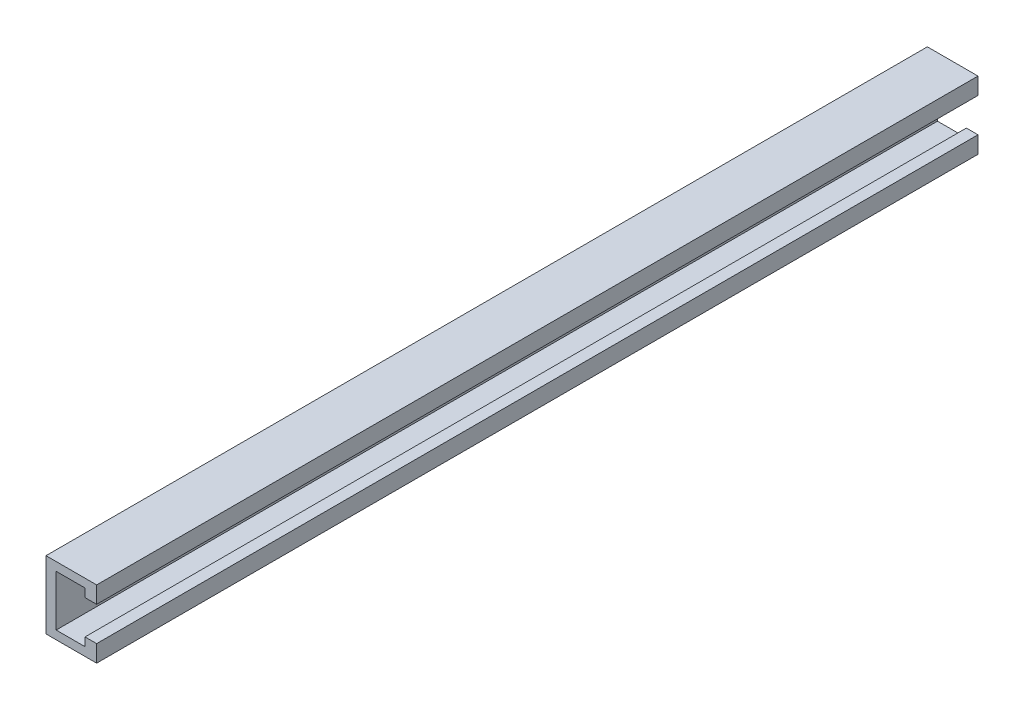
ISO-10303-21;
HEADER;
FILE_DESCRIPTION(('STEP AP214'),'2;1');
FILE_NAME('part.step','',(''),(''),'','','');
FILE_SCHEMA(('AUTOMOTIVE_DESIGN { 1 0 10303 214 1 1 1 1 }'));
ENDSEC;
DATA;
#1=APPLICATION_CONTEXT('core data for automotive mechanical design processes');
#2=APPLICATION_PROTOCOL_DEFINITION('international standard','automotive_design',2000,#1);
#3=PRODUCT_CONTEXT('',#1,'mechanical');
#4=PRODUCT('Part','Part','',(#3));
#5=PRODUCT_RELATED_PRODUCT_CATEGORY('part','',(#4));
#6=PRODUCT_DEFINITION_FORMATION('','',#4);
#7=PRODUCT_DEFINITION_CONTEXT('part definition',#1,'design');
#8=PRODUCT_DEFINITION('design','',#6,#7);
#9=PRODUCT_DEFINITION_SHAPE('','',#8);
#10=(LENGTH_UNIT() NAMED_UNIT(*) SI_UNIT(.MILLI.,.METRE.));
#11=(NAMED_UNIT(*) PLANE_ANGLE_UNIT() SI_UNIT($,.RADIAN.));
#12=(NAMED_UNIT(*) SI_UNIT($,.STERADIAN.) SOLID_ANGLE_UNIT());
#13=UNCERTAINTY_MEASURE_WITH_UNIT(LENGTH_MEASURE(1.E-05),#10,'distance_accuracy_value','');
#14=(GEOMETRIC_REPRESENTATION_CONTEXT(3) GLOBAL_UNCERTAINTY_ASSIGNED_CONTEXT((#13)) GLOBAL_UNIT_ASSIGNED_CONTEXT((#10,
#11,#12)) REPRESENTATION_CONTEXT('',''));
#15=CARTESIAN_POINT('',(0.,0.,0.));
#16=DIRECTION('',(0.,0.,1.));
#17=DIRECTION('',(1.,0.,0.));
#18=AXIS2_PLACEMENT_3D('',#15,#16,#17);
#19=CARTESIAN_POINT('',(-15.2398907550375,23.0932653061224,660.4));
#20=DIRECTION('',(1.,0.,0.));
#21=DIRECTION('',(0.,1.,0.));
#22=AXIS2_PLACEMENT_3D('',#19,#20,#21);
#23=PLANE('',#22);
#24=CARTESIAN_POINT('',(-15.2398907550375,-2.30673469387756,25.4));
#25=DIRECTION('',(-1.,0.,0.));
#26=DIRECTION('',(0.,-1.,0.));
#27=AXIS2_PLACEMENT_3D('',#24,#25,#26);
#28=CIRCLE('',#27,6.35);
#29=CARTESIAN_POINT('',(-15.2398907550375,-8.65673469387756,25.4));
#30=VERTEX_POINT('',#29);
#31=EDGE_CURVE('E208',#30,#30,#28,.T.);
#32=ORIENTED_EDGE('',*,*,#31,.F.);
#33=EDGE_LOOP('',(#32));
#34=FACE_BOUND('',#33,.T.);
#35=CARTESIAN_POINT('',(-15.2398907550375,-2.30673469387756,279.4));
#36=DIRECTION('',(-1.,0.,0.));
#37=DIRECTION('',(0.,-1.,0.));
#38=AXIS2_PLACEMENT_3D('',#35,#36,#37);
#39=CIRCLE('',#38,6.35);
#40=CARTESIAN_POINT('',(-15.2398907550375,-8.65673469387755,279.4));
#41=VERTEX_POINT('',#40);
#42=EDGE_CURVE('E213',#41,#41,#39,.T.);
#43=ORIENTED_EDGE('',*,*,#42,.F.);
#44=EDGE_LOOP('',(#43));
#45=FACE_BOUND('',#44,.T.);
#46=DIRECTION('',(0.,-1.,0.));
#47=VECTOR('',#46,1.);
#48=CARTESIAN_POINT('',(-15.2398907550375,23.0932653061224,0.));
#49=LINE('',#48,#47);
#50=CARTESIAN_POINT('',(-15.2398907550375,23.0932653061224,0.));
#51=VERTEX_POINT('',#50);
#52=CARTESIAN_POINT('',(-15.2398907550375,-27.7067346938776,0.));
#53=VERTEX_POINT('',#52);
#54=EDGE_CURVE('E161',#51,#53,#49,.T.);
#55=ORIENTED_EDGE('',*,*,#54,.T.);
#56=DIRECTION('',(0.,0.,-1.));
#57=VECTOR('',#56,1.);
#58=CARTESIAN_POINT('',(-15.2398907550375,-27.7067346938776,660.4));
#59=LINE('',#58,#57);
#60=CARTESIAN_POINT('',(-15.2398907550375,-27.7067346938776,660.4));
#61=VERTEX_POINT('',#60);
#62=EDGE_CURVE('E11',#61,#53,#59,.T.);
#63=ORIENTED_EDGE('',*,*,#62,.F.);
#64=DIRECTION('',(0.,-1.,0.));
#65=VECTOR('',#64,1.);
#66=CARTESIAN_POINT('',(-15.2398907550375,23.0932653061224,660.4));
#67=LINE('',#66,#65);
#68=CARTESIAN_POINT('',(-15.2398907550375,23.0932653061224,660.4));
#69=VERTEX_POINT('',#68);
#70=EDGE_CURVE('E183',#69,#61,#67,.T.);
#71=ORIENTED_EDGE('',*,*,#70,.F.);
#72=DIRECTION('',(0.,0.,-1.));
#73=VECTOR('',#72,1.);
#74=CARTESIAN_POINT('',(-15.2398907550375,23.0932653061224,660.4));
#75=LINE('',#74,#73);
#76=EDGE_CURVE('E157',#69,#51,#75,.T.);
#77=ORIENTED_EDGE('',*,*,#76,.T.);
#78=EDGE_LOOP('',(#55,#63,#71,#77));
#79=FACE_BOUND('',#78,.T.);
#80=ADVANCED_FACE('F39',(#34,#45,#79),#23,.F.);
#81=CARTESIAN_POINT('',(-15.2398907550375,-27.7067346938776,660.4));
#82=DIRECTION('',(0.,1.,0.));
#83=DIRECTION('',(0.,0.,1.));
#84=AXIS2_PLACEMENT_3D('',#81,#82,#83);
#85=PLANE('',#84);
#86=DIRECTION('',(1.,0.,0.));
#87=VECTOR('',#86,1.);
#88=CARTESIAN_POINT('',(-15.2398907550375,-27.7067346938776,0.));
#89=LINE('',#88,#87);
#90=CARTESIAN_POINT('',(22.7045990408808,-27.7067346938776,0.));
#91=VERTEX_POINT('',#90);
#92=EDGE_CURVE('E164',#53,#91,#89,.T.);
#93=ORIENTED_EDGE('',*,*,#92,.T.);
#94=DIRECTION('',(0.,0.,-1.));
#95=VECTOR('',#94,1.);
#96=CARTESIAN_POINT('',(22.7045990408808,-27.7067346938776,660.4));
#97=LINE('',#96,#95);
#98=CARTESIAN_POINT('',(22.7045990408808,-27.7067346938776,660.4));
#99=VERTEX_POINT('',#98);
#100=EDGE_CURVE('E48',#99,#91,#97,.T.);
#101=ORIENTED_EDGE('',*,*,#100,.F.);
#102=DIRECTION('',(1.,0.,0.));
#103=VECTOR('',#102,1.);
#104=CARTESIAN_POINT('',(-15.2398907550375,-27.7067346938776,660.4));
#105=LINE('',#104,#103);
#106=EDGE_CURVE('E112',#61,#99,#105,.T.);
#107=ORIENTED_EDGE('',*,*,#106,.F.);
#108=ORIENTED_EDGE('',*,*,#62,.T.);
#109=EDGE_LOOP('',(#93,#101,#107,#108));
#110=FACE_BOUND('',#109,.T.);
#111=ADVANCED_FACE('F261',(#110),#85,.F.);
#112=CARTESIAN_POINT('',(22.7045990408808,-15.0067346938776,660.4));
#113=DIRECTION('',(-1.,0.,0.));
#114=DIRECTION('',(0.,0.,1.));
#115=AXIS2_PLACEMENT_3D('',#112,#113,#114);
#116=PLANE('',#115);
#117=DIRECTION('',(0.,1.,0.));
#118=VECTOR('',#117,1.);
#119=CARTESIAN_POINT('',(22.7045990408808,-15.0067346938776,0.));
#120=LINE('',#119,#118);
#121=CARTESIAN_POINT('',(22.7045990408808,-15.0067346938776,0.));
#122=VERTEX_POINT('',#121);
#123=EDGE_CURVE('E166',#91,#122,#120,.T.);
#124=ORIENTED_EDGE('',*,*,#123,.T.);
#125=DIRECTION('',(0.,0.,-1.));
#126=VECTOR('',#125,1.);
#127=CARTESIAN_POINT('',(22.7045990408808,-15.0067346938776,660.4));
#128=LINE('',#127,#126);
#129=CARTESIAN_POINT('',(22.7045990408808,-15.0067346938776,660.4));
#130=VERTEX_POINT('',#129);
#131=EDGE_CURVE('E202',#130,#122,#128,.T.);
#132=ORIENTED_EDGE('',*,*,#131,.F.);
#133=DIRECTION('',(0.,1.,0.));
#134=VECTOR('',#133,1.);
#135=CARTESIAN_POINT('',(22.7045990408808,-15.0067346938776,660.4));
#136=LINE('',#135,#134);
#137=EDGE_CURVE('E222',#99,#130,#136,.T.);
#138=ORIENTED_EDGE('',*,*,#137,.F.);
#139=ORIENTED_EDGE('',*,*,#100,.T.);
#140=EDGE_LOOP('',(#124,#132,#138,#139));
#141=FACE_BOUND('',#140,.T.);
#142=ADVANCED_FACE('F268',(#141),#116,.F.);
#143=CARTESIAN_POINT('',(13.9960276123094,-15.0067346938776,660.4));
#144=DIRECTION('',(0.,-1.,0.));
#145=DIRECTION('',(0.,0.,-1.));
#146=AXIS2_PLACEMENT_3D('',#143,#144,#145);
#147=PLANE('',#146);
#148=DIRECTION('',(-1.,0.,0.));
#149=VECTOR('',#148,1.);
#150=CARTESIAN_POINT('',(13.9960276123094,-15.0067346938776,0.));
#151=LINE('',#150,#149);
#152=CARTESIAN_POINT('',(13.9960276123094,-15.0067346938776,0.));
#153=VERTEX_POINT('',#152);
#154=EDGE_CURVE('E168',#122,#153,#151,.T.);
#155=ORIENTED_EDGE('',*,*,#154,.T.);
#156=DIRECTION('',(0.,0.,-1.));
#157=VECTOR('',#156,1.);
#158=CARTESIAN_POINT('',(13.9960276123094,-15.0067346938776,660.4));
#159=LINE('',#158,#157);
#160=CARTESIAN_POINT('',(13.9960276123094,-15.0067346938776,660.4));
#161=VERTEX_POINT('',#160);
#162=EDGE_CURVE('E199',#161,#153,#159,.T.);
#163=ORIENTED_EDGE('',*,*,#162,.F.);
#164=DIRECTION('',(-1.,0.,0.));
#165=VECTOR('',#164,1.);
#166=CARTESIAN_POINT('',(13.9960276123094,-15.0067346938776,660.4));
#167=LINE('',#166,#165);
#168=EDGE_CURVE('E224',#130,#161,#167,.T.);
#169=ORIENTED_EDGE('',*,*,#168,.F.);
#170=ORIENTED_EDGE('',*,*,#131,.T.);
#171=EDGE_LOOP('',(#155,#163,#169,#170));
#172=FACE_BOUND('',#171,.T.);
#173=ADVANCED_FACE('F352',(#172),#147,.F.);
#174=CARTESIAN_POINT('',(13.9960276123094,-15.0067346938776,660.4));
#175=DIRECTION('',(1.,0.,0.));
#176=DIRECTION('',(0.,1.,0.));
#177=AXIS2_PLACEMENT_3D('',#174,#175,#176);
#178=PLANE('',#177);
#179=DIRECTION('',(0.,-1.,0.));
#180=VECTOR('',#179,1.);
#181=CARTESIAN_POINT('',(13.9960276123094,-15.0067346938776,0.));
#182=LINE('',#181,#180);
#183=CARTESIAN_POINT('',(13.9960276123094,-21.3567346938776,0.));
#184=VERTEX_POINT('',#183);
#185=EDGE_CURVE('E170',#153,#184,#182,.T.);
#186=ORIENTED_EDGE('',*,*,#185,.T.);
#187=DIRECTION('',(0.,0.,-1.));
#188=VECTOR('',#187,1.);
#189=CARTESIAN_POINT('',(13.9960276123094,-21.3567346938776,660.4));
#190=LINE('',#189,#188);
#191=CARTESIAN_POINT('',(13.9960276123094,-21.3567346938776,660.4));
#192=VERTEX_POINT('',#191);
#193=EDGE_CURVE('E196',#192,#184,#190,.T.);
#194=ORIENTED_EDGE('',*,*,#193,.F.);
#195=DIRECTION('',(0.,-1.,0.));
#196=VECTOR('',#195,1.);
#197=CARTESIAN_POINT('',(13.9960276123094,-15.0067346938776,660.4));
#198=LINE('',#197,#196);
#199=EDGE_CURVE('E226',#161,#192,#198,.T.);
#200=ORIENTED_EDGE('',*,*,#199,.F.);
#201=ORIENTED_EDGE('',*,*,#162,.T.);
#202=EDGE_LOOP('',(#186,#194,#200,#201));
#203=FACE_BOUND('',#202,.T.);
#204=ADVANCED_FACE('F342',(#203),#178,.F.);
#205=CARTESIAN_POINT('',(-7.61989075503754,-21.3567346938776,660.4));
#206=DIRECTION('',(0.,-1.,0.));
#207=DIRECTION('',(0.,0.,-1.));
#208=AXIS2_PLACEMENT_3D('',#205,#206,#207);
#209=PLANE('',#208);
#210=DIRECTION('',(-1.,0.,0.));
#211=VECTOR('',#210,1.);
#212=CARTESIAN_POINT('',(-7.61989075503754,-21.3567346938776,0.));
#213=LINE('',#212,#211);
#214=CARTESIAN_POINT('',(-7.61989075503754,-21.3567346938776,0.));
#215=VERTEX_POINT('',#214);
#216=EDGE_CURVE('E172',#184,#215,#213,.T.);
#217=ORIENTED_EDGE('',*,*,#216,.T.);
#218=DIRECTION('',(0.,0.,-1.));
#219=VECTOR('',#218,1.);
#220=CARTESIAN_POINT('',(-7.61989075503754,-21.3567346938776,660.4));
#221=LINE('',#220,#219);
#222=CARTESIAN_POINT('',(-7.61989075503754,-21.3567346938776,660.4));
#223=VERTEX_POINT('',#222);
#224=EDGE_CURVE('E193',#223,#215,#221,.T.);
#225=ORIENTED_EDGE('',*,*,#224,.F.);
#226=DIRECTION('',(-1.,0.,0.));
#227=VECTOR('',#226,1.);
#228=CARTESIAN_POINT('',(-7.61989075503754,-21.3567346938776,660.4));
#229=LINE('',#228,#227);
#230=EDGE_CURVE('E228',#192,#223,#229,.T.);
#231=ORIENTED_EDGE('',*,*,#230,.F.);
#232=ORIENTED_EDGE('',*,*,#193,.T.);
#233=EDGE_LOOP('',(#217,#225,#231,#232));
#234=FACE_BOUND('',#233,.T.);
#235=ADVANCED_FACE('F333',(#234),#209,.F.);
#236=CARTESIAN_POINT('',(-7.61989075503754,16.7432653061224,660.4));
#237=DIRECTION('',(-1.,0.,0.));
#238=DIRECTION('',(0.,-1.,0.));
#239=AXIS2_PLACEMENT_3D('',#236,#237,#238);
#240=PLANE('',#239);
#241=CARTESIAN_POINT('',(-7.61989075503754,-2.30673469387756,25.4));
#242=DIRECTION('',(-1.,0.,0.));
#243=DIRECTION('',(0.,-1.,0.));
#244=AXIS2_PLACEMENT_3D('',#241,#242,#243);
#245=CIRCLE('',#244,6.35);
#246=CARTESIAN_POINT('',(-7.61989075503754,-8.65673469387756,25.4));
#247=VERTEX_POINT('',#246);
#248=EDGE_CURVE('E42',#247,#247,#245,.T.);
#249=ORIENTED_EDGE('',*,*,#248,.T.);
#250=EDGE_LOOP('',(#249));
#251=FACE_BOUND('',#250,.T.);
#252=CARTESIAN_POINT('',(-7.61989075503754,-2.30673469387756,279.4));
#253=DIRECTION('',(-1.,0.,0.));
#254=DIRECTION('',(0.,-1.,0.));
#255=AXIS2_PLACEMENT_3D('',#252,#253,#254);
#256=CIRCLE('',#255,6.35);
#257=CARTESIAN_POINT('',(-7.61989075503754,-8.65673469387755,279.4));
#258=VERTEX_POINT('',#257);
#259=EDGE_CURVE('E206',#258,#258,#256,.T.);
#260=ORIENTED_EDGE('',*,*,#259,.T.);
#261=EDGE_LOOP('',(#260));
#262=FACE_BOUND('',#261,.T.);
#263=DIRECTION('',(0.,1.,0.));
#264=VECTOR('',#263,1.);
#265=CARTESIAN_POINT('',(-7.61989075503754,16.7432653061224,0.));
#266=LINE('',#265,#264);
#267=CARTESIAN_POINT('',(-7.61989075503754,16.7432653061224,0.));
#268=VERTEX_POINT('',#267);
#269=EDGE_CURVE('E174',#215,#268,#266,.T.);
#270=ORIENTED_EDGE('',*,*,#269,.T.);
#271=DIRECTION('',(0.,0.,-1.));
#272=VECTOR('',#271,1.);
#273=CARTESIAN_POINT('',(-7.61989075503754,16.7432653061224,660.4));
#274=LINE('',#273,#272);
#275=CARTESIAN_POINT('',(-7.61989075503754,16.7432653061224,660.4));
#276=VERTEX_POINT('',#275);
#277=EDGE_CURVE('E190',#276,#268,#274,.T.);
#278=ORIENTED_EDGE('',*,*,#277,.F.);
#279=DIRECTION('',(0.,1.,0.));
#280=VECTOR('',#279,1.);
#281=CARTESIAN_POINT('',(-7.61989075503754,16.7432653061224,660.4));
#282=LINE('',#281,#280);
#283=EDGE_CURVE('E230',#223,#276,#282,.T.);
#284=ORIENTED_EDGE('',*,*,#283,.F.);
#285=ORIENTED_EDGE('',*,*,#224,.T.);
#286=EDGE_LOOP('',(#270,#278,#284,#285));
#287=FACE_BOUND('',#286,.T.);
#288=ADVANCED_FACE('F324',(#251,#262,#287),#240,.F.);
#289=CARTESIAN_POINT('',(-7.61989075503754,16.7432653061224,660.4));
#290=DIRECTION('',(0.,1.,0.));
#291=DIRECTION('',(0.,0.,1.));
#292=AXIS2_PLACEMENT_3D('',#289,#290,#291);
#293=PLANE('',#292);
#294=DIRECTION('',(1.,0.,0.));
#295=VECTOR('',#294,1.);
#296=CARTESIAN_POINT('',(-7.61989075503754,16.7432653061224,0.));
#297=LINE('',#296,#295);
#298=CARTESIAN_POINT('',(13.9960276123094,16.7432653061224,0.));
#299=VERTEX_POINT('',#298);
#300=EDGE_CURVE('E176',#268,#299,#297,.T.);
#301=ORIENTED_EDGE('',*,*,#300,.T.);
#302=DIRECTION('',(0.,0.,-1.));
#303=VECTOR('',#302,1.);
#304=CARTESIAN_POINT('',(13.9960276123094,16.7432653061224,660.4));
#305=LINE('',#304,#303);
#306=CARTESIAN_POINT('',(13.9960276123094,16.7432653061224,660.4));
#307=VERTEX_POINT('',#306);
#308=EDGE_CURVE('E187',#307,#299,#305,.T.);
#309=ORIENTED_EDGE('',*,*,#308,.F.);
#310=DIRECTION('',(1.,0.,0.));
#311=VECTOR('',#310,1.);
#312=CARTESIAN_POINT('',(-7.61989075503754,16.7432653061224,660.4));
#313=LINE('',#312,#311);
#314=EDGE_CURVE('E232',#276,#307,#313,.T.);
#315=ORIENTED_EDGE('',*,*,#314,.F.);
#316=ORIENTED_EDGE('',*,*,#277,.T.);
#317=EDGE_LOOP('',(#301,#309,#315,#316));
#318=FACE_BOUND('',#317,.T.);
#319=ADVANCED_FACE('F238',(#318),#293,.F.);
#320=CARTESIAN_POINT('',(13.9960276123094,16.7432653061224,660.4));
#321=DIRECTION('',(1.,0.,0.));
#322=DIRECTION('',(0.,1.,0.));
#323=AXIS2_PLACEMENT_3D('',#320,#321,#322);
#324=PLANE('',#323);
#325=DIRECTION('',(0.,-1.,0.));
#326=VECTOR('',#325,1.);
#327=CARTESIAN_POINT('',(13.9960276123094,16.7432653061224,0.));
#328=LINE('',#327,#326);
#329=CARTESIAN_POINT('',(13.9960276123094,10.4912685626584,0.));
#330=VERTEX_POINT('',#329);
#331=EDGE_CURVE('E178',#299,#330,#328,.T.);
#332=ORIENTED_EDGE('',*,*,#331,.T.);
#333=DIRECTION('',(0.,0.,-1.));
#334=VECTOR('',#333,1.);
#335=CARTESIAN_POINT('',(13.9960276123094,10.4912685626584,660.4));
#336=LINE('',#335,#334);
#337=CARTESIAN_POINT('',(13.9960276123094,10.4912685626584,660.4));
#338=VERTEX_POINT('',#337);
#339=EDGE_CURVE('E152',#338,#330,#336,.T.);
#340=ORIENTED_EDGE('',*,*,#339,.F.);
#341=DIRECTION('',(0.,-1.,0.));
#342=VECTOR('',#341,1.);
#343=CARTESIAN_POINT('',(13.9960276123094,16.7432653061224,660.4));
#344=LINE('',#343,#342);
#345=EDGE_CURVE('E143',#307,#338,#344,.T.);
#346=ORIENTED_EDGE('',*,*,#345,.F.);
#347=ORIENTED_EDGE('',*,*,#308,.T.);
#348=EDGE_LOOP('',(#332,#340,#346,#347));
#349=FACE_BOUND('',#348,.T.);
#350=ADVANCED_FACE('F242',(#349),#324,.F.);
#351=CARTESIAN_POINT('',(13.9960276123094,10.4912685626584,660.4));
#352=DIRECTION('',(0.,1.,0.));
#353=DIRECTION('',(0.,0.,1.));
#354=AXIS2_PLACEMENT_3D('',#351,#352,#353);
#355=PLANE('',#354);
#356=DIRECTION('',(1.,0.,0.));
#357=VECTOR('',#356,1.);
#358=CARTESIAN_POINT('',(13.9960276123094,10.4912685626584,0.));
#359=LINE('',#358,#357);
#360=CARTESIAN_POINT('',(22.7045990408808,10.4912685626584,0.));
#361=VERTEX_POINT('',#360);
#362=EDGE_CURVE('E151',#330,#361,#359,.T.);
#363=ORIENTED_EDGE('',*,*,#362,.T.);
#364=DIRECTION('',(0.,0.,-1.));
#365=VECTOR('',#364,1.);
#366=CARTESIAN_POINT('',(22.7045990408808,10.4912685626584,660.4));
#367=LINE('',#366,#365);
#368=CARTESIAN_POINT('',(22.7045990408808,10.4912685626584,660.4));
#369=VERTEX_POINT('',#368);
#370=EDGE_CURVE('E148',#369,#361,#367,.T.);
#371=ORIENTED_EDGE('',*,*,#370,.F.);
#372=DIRECTION('',(1.,0.,0.));
#373=VECTOR('',#372,1.);
#374=CARTESIAN_POINT('',(13.9960276123094,10.4912685626584,660.4));
#375=LINE('',#374,#373);
#376=EDGE_CURVE('E137',#338,#369,#375,.T.);
#377=ORIENTED_EDGE('',*,*,#376,.F.);
#378=ORIENTED_EDGE('',*,*,#339,.T.);
#379=EDGE_LOOP('',(#363,#371,#377,#378));
#380=FACE_BOUND('',#379,.T.);
#381=ADVANCED_FACE('F149',(#380),#355,.F.);
#382=CARTESIAN_POINT('',(22.7045990408808,23.0932653061224,660.4));
#383=DIRECTION('',(-1.,0.,0.));
#384=DIRECTION('',(0.,0.,1.));
#385=AXIS2_PLACEMENT_3D('',#382,#383,#384);
#386=PLANE('',#385);
#387=DIRECTION('',(0.,1.,0.));
#388=VECTOR('',#387,1.);
#389=CARTESIAN_POINT('',(22.7045990408808,23.0932653061224,0.));
#390=LINE('',#389,#388);
#391=CARTESIAN_POINT('',(22.7045990408808,23.0932653061224,0.));
#392=VERTEX_POINT('',#391);
#393=EDGE_CURVE('E98',#361,#392,#390,.T.);
#394=ORIENTED_EDGE('',*,*,#393,.T.);
#395=DIRECTION('',(0.,0.,-1.));
#396=VECTOR('',#395,1.);
#397=CARTESIAN_POINT('',(22.7045990408808,23.0932653061224,660.4));
#398=LINE('',#397,#396);
#399=CARTESIAN_POINT('',(22.7045990408808,23.0932653061224,660.4));
#400=VERTEX_POINT('',#399);
#401=EDGE_CURVE('E153',#400,#392,#398,.T.);
#402=ORIENTED_EDGE('',*,*,#401,.F.);
#403=DIRECTION('',(0.,1.,0.));
#404=VECTOR('',#403,1.);
#405=CARTESIAN_POINT('',(22.7045990408808,23.0932653061224,660.4));
#406=LINE('',#405,#404);
#407=EDGE_CURVE('E141',#369,#400,#406,.T.);
#408=ORIENTED_EDGE('',*,*,#407,.F.);
#409=ORIENTED_EDGE('',*,*,#370,.T.);
#410=EDGE_LOOP('',(#394,#402,#408,#409));
#411=FACE_BOUND('',#410,.T.);
#412=ADVANCED_FACE('F155',(#411),#386,.F.);
#413=CARTESIAN_POINT('',(-15.2398907550375,23.0932653061224,660.4));
#414=DIRECTION('',(0.,-1.,0.));
#415=DIRECTION('',(0.,0.,-1.));
#416=AXIS2_PLACEMENT_3D('',#413,#414,#415);
#417=PLANE('',#416);
#418=DIRECTION('',(-1.,0.,0.));
#419=VECTOR('',#418,1.);
#420=CARTESIAN_POINT('',(-15.2398907550375,23.0932653061224,0.));
#421=LINE('',#420,#419);
#422=EDGE_CURVE('E104',#392,#51,#421,.T.);
#423=ORIENTED_EDGE('',*,*,#422,.T.);
#424=ORIENTED_EDGE('',*,*,#76,.F.);
#425=DIRECTION('',(-1.,0.,0.));
#426=VECTOR('',#425,1.);
#427=CARTESIAN_POINT('',(-15.2398907550375,23.0932653061224,660.4));
#428=LINE('',#427,#426);
#429=EDGE_CURVE('E57',#400,#69,#428,.T.);
#430=ORIENTED_EDGE('',*,*,#429,.F.);
#431=ORIENTED_EDGE('',*,*,#401,.T.);
#432=EDGE_LOOP('',(#423,#424,#430,#431));
#433=FACE_BOUND('',#432,.T.);
#434=ADVANCED_FACE('F250',(#433),#417,.F.);
#435=CARTESIAN_POINT('',(0.,0.,660.4));
#436=DIRECTION('',(0.,0.,1.));
#437=DIRECTION('',(1.,0.,0.));
#438=AXIS2_PLACEMENT_3D('',#435,#436,#437);
#439=PLANE('',#438);
#440=ORIENTED_EDGE('',*,*,#70,.T.);
#441=ORIENTED_EDGE('',*,*,#106,.T.);
#442=ORIENTED_EDGE('',*,*,#137,.T.);
#443=ORIENTED_EDGE('',*,*,#168,.T.);
#444=ORIENTED_EDGE('',*,*,#199,.T.);
#445=ORIENTED_EDGE('',*,*,#230,.T.);
#446=ORIENTED_EDGE('',*,*,#283,.T.);
#447=ORIENTED_EDGE('',*,*,#314,.T.);
#448=ORIENTED_EDGE('',*,*,#345,.T.);
#449=ORIENTED_EDGE('',*,*,#376,.T.);
#450=ORIENTED_EDGE('',*,*,#407,.T.);
#451=ORIENTED_EDGE('',*,*,#429,.T.);
#452=EDGE_LOOP('',(#440,#441,#442,#443,#444,#445,#446,#447,#448,#449,#450,#451));
#453=FACE_BOUND('',#452,.T.);
#454=ADVANCED_FACE('F139',(#453),#439,.T.);
#455=CARTESIAN_POINT('',(0.,0.,0.));
#456=DIRECTION('',(0.,0.,1.));
#457=DIRECTION('',(1.,0.,0.));
#458=AXIS2_PLACEMENT_3D('',#455,#456,#457);
#459=PLANE('',#458);
#460=ORIENTED_EDGE('',*,*,#54,.F.);
#461=ORIENTED_EDGE('',*,*,#422,.F.);
#462=ORIENTED_EDGE('',*,*,#393,.F.);
#463=ORIENTED_EDGE('',*,*,#362,.F.);
#464=ORIENTED_EDGE('',*,*,#331,.F.);
#465=ORIENTED_EDGE('',*,*,#300,.F.);
#466=ORIENTED_EDGE('',*,*,#269,.F.);
#467=ORIENTED_EDGE('',*,*,#216,.F.);
#468=ORIENTED_EDGE('',*,*,#185,.F.);
#469=ORIENTED_EDGE('',*,*,#154,.F.);
#470=ORIENTED_EDGE('',*,*,#123,.F.);
#471=ORIENTED_EDGE('',*,*,#92,.F.);
#472=EDGE_LOOP('',(#460,#461,#462,#463,#464,#465,#466,#467,#468,#469,#470,#471));
#473=FACE_BOUND('',#472,.T.);
#474=ADVANCED_FACE('F245',(#473),#459,.F.);
#475=CARTESIAN_POINT('',(22.7045990408808,-2.30673469387755,279.4));
#476=DIRECTION('',(-1.,0.,0.));
#477=DIRECTION('',(0.,-1.,0.));
#478=AXIS2_PLACEMENT_3D('',#475,#476,#477);
#479=CYLINDRICAL_SURFACE('',#478,6.35);
#480=ORIENTED_EDGE('',*,*,#42,.T.);
#481=EDGE_LOOP('',(#480));
#482=FACE_BOUND('',#481,.T.);
#483=ORIENTED_EDGE('',*,*,#259,.F.);
#484=EDGE_LOOP('',(#483));
#485=FACE_BOUND('',#484,.T.);
#486=ADVANCED_FACE('F272',(#482,#485),#479,.F.);
#487=CARTESIAN_POINT('',(22.7045990408808,-2.30673469387755,25.4));
#488=DIRECTION('',(-1.,0.,0.));
#489=DIRECTION('',(0.,-1.,0.));
#490=AXIS2_PLACEMENT_3D('',#487,#488,#489);
#491=CYLINDRICAL_SURFACE('',#490,6.35);
#492=ORIENTED_EDGE('',*,*,#31,.T.);
#493=EDGE_LOOP('',(#492));
#494=FACE_BOUND('',#493,.T.);
#495=ORIENTED_EDGE('',*,*,#248,.F.);
#496=EDGE_LOOP('',(#495));
#497=FACE_BOUND('',#496,.T.);
#498=ADVANCED_FACE('F275',(#494,#497),#491,.F.);
#499=CLOSED_SHELL('',(#80,#111,#142,#173,#204,#235,#288,#319,#350,#381,#412,#434,#454,#474,#486,#498));
#500=MANIFOLD_SOLID_BREP('B2',#499);
#501=ADVANCED_BREP_SHAPE_REPRESENTATION('',(#18,#500),#14);
#502=SHAPE_DEFINITION_REPRESENTATION(#9,#501);
ENDSEC;
END-ISO-10303-21;
